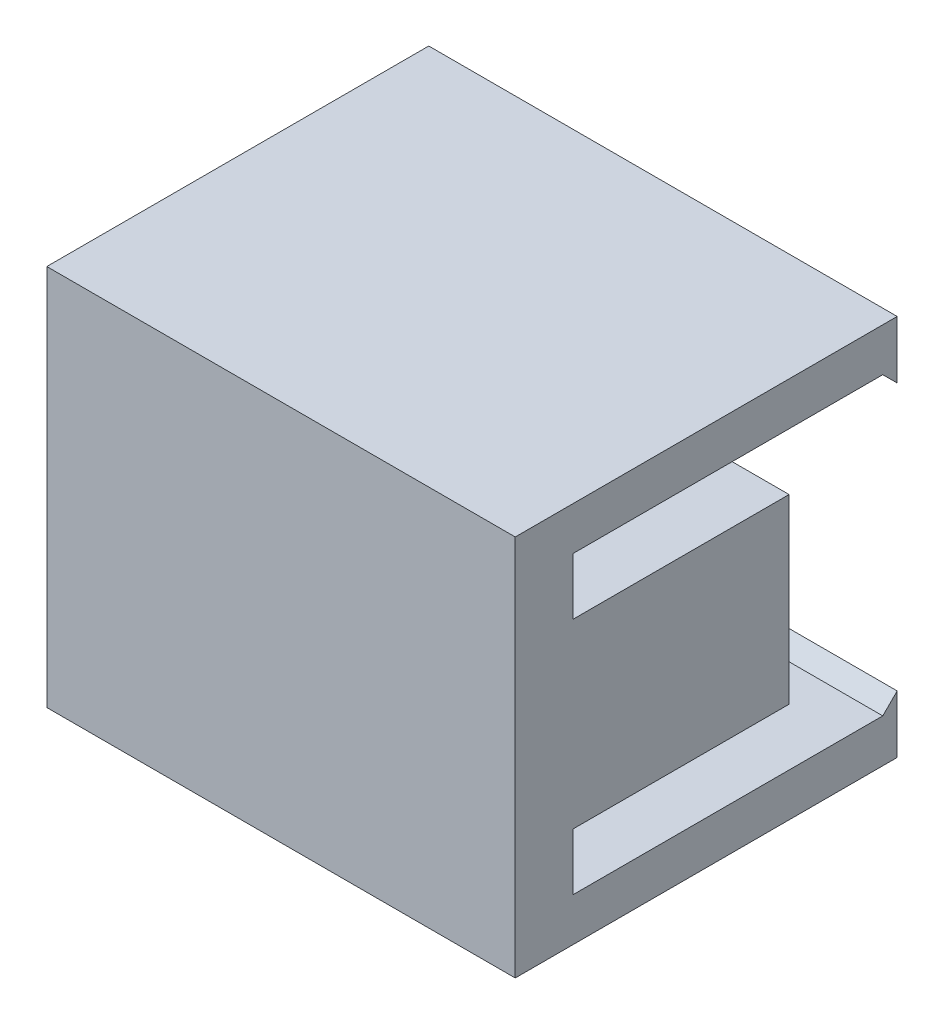
ISO-10303-21;
HEADER;
FILE_DESCRIPTION(('STEP AP214'),'2;1');
FILE_NAME('part.step','',(''),(''),'','','');
FILE_SCHEMA(('AUTOMOTIVE_DESIGN { 1 0 10303 214 1 1 1 1 }'));
ENDSEC;
DATA;
#1=APPLICATION_CONTEXT('core data for automotive mechanical design processes');
#2=APPLICATION_PROTOCOL_DEFINITION('international standard','automotive_design',2000,#1);
#3=PRODUCT_CONTEXT('',#1,'mechanical');
#4=PRODUCT('Part','Part','',(#3));
#5=PRODUCT_RELATED_PRODUCT_CATEGORY('part','',(#4));
#6=PRODUCT_DEFINITION_FORMATION('','',#4);
#7=PRODUCT_DEFINITION_CONTEXT('part definition',#1,'design');
#8=PRODUCT_DEFINITION('design','',#6,#7);
#9=PRODUCT_DEFINITION_SHAPE('','',#8);
#10=(LENGTH_UNIT() NAMED_UNIT(*) SI_UNIT(.MILLI.,.METRE.));
#11=(NAMED_UNIT(*) PLANE_ANGLE_UNIT() SI_UNIT($,.RADIAN.));
#12=(NAMED_UNIT(*) SI_UNIT($,.STERADIAN.) SOLID_ANGLE_UNIT());
#13=UNCERTAINTY_MEASURE_WITH_UNIT(LENGTH_MEASURE(1.E-05),#10,'distance_accuracy_value','');
#14=(GEOMETRIC_REPRESENTATION_CONTEXT(3) GLOBAL_UNCERTAINTY_ASSIGNED_CONTEXT((#13)) GLOBAL_UNIT_ASSIGNED_CONTEXT((#10,
#11,#12)) REPRESENTATION_CONTEXT('',''));
#15=CARTESIAN_POINT('',(0.,0.,0.));
#16=DIRECTION('',(0.,0.,1.));
#17=DIRECTION('',(1.,0.,0.));
#18=AXIS2_PLACEMENT_3D('',#15,#16,#17);
#19=CARTESIAN_POINT('',(0.,0.,0.));
#20=DIRECTION('',(0.,0.,1.));
#21=DIRECTION('',(1.,0.,0.));
#22=AXIS2_PLACEMENT_3D('',#19,#20,#21);
#23=PLANE('',#22);
#24=DIRECTION('',(1.,0.,0.));
#25=VECTOR('',#24,1.);
#26=CARTESIAN_POINT('',(0.,-2.01990678049208,0.));
#27=LINE('',#26,#25);
#28=CARTESIAN_POINT('',(-16.25,-2.01990678049208,0.));
#29=VERTEX_POINT('',#28);
#30=CARTESIAN_POINT('',(-13.25,-2.01990678049208,0.));
#31=VERTEX_POINT('',#30);
#32=EDGE_CURVE('E204',#29,#31,#27,.T.);
#33=ORIENTED_EDGE('',*,*,#32,.F.);
#34=DIRECTION('',(0.,-1.,0.));
#35=VECTOR('',#34,1.);
#36=CARTESIAN_POINT('',(-16.25,13.25,0.));
#37=LINE('',#36,#35);
#38=CARTESIAN_POINT('',(-16.25,2.,0.));
#39=VERTEX_POINT('',#38);
#40=EDGE_CURVE('E335',#39,#29,#37,.T.);
#41=ORIENTED_EDGE('',*,*,#40,.F.);
#42=DIRECTION('',(1.,0.,0.));
#43=VECTOR('',#42,1.);
#44=CARTESIAN_POINT('',(0.,2.,0.));
#45=LINE('',#44,#43);
#46=CARTESIAN_POINT('',(-13.25,2.,0.));
#47=VERTEX_POINT('',#46);
#48=EDGE_CURVE('E57',#39,#47,#45,.T.);
#49=ORIENTED_EDGE('',*,*,#48,.T.);
#50=DIRECTION('',(0.,-1.,0.));
#51=VECTOR('',#50,1.);
#52=CARTESIAN_POINT('',(-13.25,0.,0.));
#53=LINE('',#52,#51);
#54=CARTESIAN_POINT('',(-13.25,5.5,0.));
#55=VERTEX_POINT('',#54);
#56=EDGE_CURVE('E209',#55,#47,#53,.T.);
#57=ORIENTED_EDGE('',*,*,#56,.F.);
#58=DIRECTION('',(1.,0.,0.));
#59=VECTOR('',#58,1.);
#60=CARTESIAN_POINT('',(0.,5.5,0.));
#61=LINE('',#60,#59);
#62=CARTESIAN_POINT('',(-16.25,5.5,0.));
#63=VERTEX_POINT('',#62);
#64=EDGE_CURVE('E206',#63,#55,#61,.T.);
#65=ORIENTED_EDGE('',*,*,#64,.F.);
#66=CARTESIAN_POINT('',(-16.25,10.25,0.));
#67=VERTEX_POINT('',#66);
#68=EDGE_CURVE('E323',#67,#63,#37,.T.);
#69=ORIENTED_EDGE('',*,*,#68,.F.);
#70=DIRECTION('',(-1.,0.,0.));
#71=VECTOR('',#70,1.);
#72=CARTESIAN_POINT('',(0.,10.25,0.));
#73=LINE('',#72,#71);
#74=CARTESIAN_POINT('',(16.25,10.25,0.));
#75=VERTEX_POINT('',#74);
#76=EDGE_CURVE('E254',#75,#67,#73,.T.);
#77=ORIENTED_EDGE('',*,*,#76,.F.);
#78=DIRECTION('',(0.,1.,0.));
#79=VECTOR('',#78,1.);
#80=CARTESIAN_POINT('',(16.25,13.25,0.));
#81=LINE('',#80,#79);
#82=CARTESIAN_POINT('',(16.25,6.30000000000001,0.));
#83=VERTEX_POINT('',#82);
#84=EDGE_CURVE('E318',#83,#75,#81,.T.);
#85=ORIENTED_EDGE('',*,*,#84,.F.);
#86=DIRECTION('',(1.,0.,0.));
#87=VECTOR('',#86,1.);
#88=CARTESIAN_POINT('',(0.,6.30000000000001,0.));
#89=LINE('',#88,#87);
#90=CARTESIAN_POINT('',(9.75,6.30000000000001,0.));
#91=VERTEX_POINT('',#90);
#92=EDGE_CURVE('E293',#91,#83,#89,.T.);
#93=ORIENTED_EDGE('',*,*,#92,.F.);
#94=DIRECTION('',(0.,1.,0.));
#95=VECTOR('',#94,1.);
#96=CARTESIAN_POINT('',(9.75,0.,0.));
#97=LINE('',#96,#95);
#98=CARTESIAN_POINT('',(9.75,-6.29999999999999,0.));
#99=VERTEX_POINT('',#98);
#100=EDGE_CURVE('E302',#99,#91,#97,.T.);
#101=ORIENTED_EDGE('',*,*,#100,.F.);
#102=DIRECTION('',(1.,0.,0.));
#103=VECTOR('',#102,1.);
#104=CARTESIAN_POINT('',(0.,-6.29999999999999,0.));
#105=LINE('',#104,#103);
#106=CARTESIAN_POINT('',(16.25,-6.29999999999999,0.));
#107=VERTEX_POINT('',#106);
#108=EDGE_CURVE('E288',#99,#107,#105,.T.);
#109=ORIENTED_EDGE('',*,*,#108,.T.);
#110=CARTESIAN_POINT('',(16.25,-10.25,0.));
#111=VERTEX_POINT('',#110);
#112=EDGE_CURVE('E330',#111,#107,#81,.T.);
#113=ORIENTED_EDGE('',*,*,#112,.F.);
#114=DIRECTION('',(-1.,0.,0.));
#115=VECTOR('',#114,1.);
#116=CARTESIAN_POINT('',(0.,-10.25,0.));
#117=LINE('',#116,#115);
#118=CARTESIAN_POINT('',(-16.25,-10.25,0.));
#119=VERTEX_POINT('',#118);
#120=EDGE_CURVE('E271',#111,#119,#117,.T.);
#121=ORIENTED_EDGE('',*,*,#120,.T.);
#122=CARTESIAN_POINT('',(-16.25,-5.51990678049208,0.));
#123=VERTEX_POINT('',#122);
#124=EDGE_CURVE('E332',#123,#119,#37,.T.);
#125=ORIENTED_EDGE('',*,*,#124,.F.);
#126=DIRECTION('',(1.,0.,0.));
#127=VECTOR('',#126,1.);
#128=CARTESIAN_POINT('',(0.,-5.51990678049208,0.));
#129=LINE('',#128,#127);
#130=CARTESIAN_POINT('',(-13.25,-5.51990678049208,0.));
#131=VERTEX_POINT('',#130);
#132=EDGE_CURVE('E49',#123,#131,#129,.T.);
#133=ORIENTED_EDGE('',*,*,#132,.T.);
#134=DIRECTION('',(0.,-1.,0.));
#135=VECTOR('',#134,1.);
#136=CARTESIAN_POINT('',(-13.25,0.,0.));
#137=LINE('',#136,#135);
#138=EDGE_CURVE('E711',#31,#131,#137,.T.);
#139=ORIENTED_EDGE('',*,*,#138,.F.);
#140=EDGE_LOOP('',(#33,#41,#49,#57,#65,#69,#77,#85,#93,#101,#109,#113,#121,#125,#133,#139));
#141=FACE_BOUND('',#140,.T.);
#142=ADVANCED_FACE('F34',(#141),#23,.F.);
#143=CARTESIAN_POINT('',(0.,-10.25,-22.5));
#144=DIRECTION('',(0.,1.,0.));
#145=DIRECTION('',(0.,0.,1.));
#146=AXIS2_PLACEMENT_3D('',#143,#144,#145);
#147=PLANE('',#146);
#148=DIRECTION('',(0.,0.,1.));
#149=VECTOR('',#148,1.);
#150=CARTESIAN_POINT('',(16.25,-10.25,-22.5));
#151=LINE('',#150,#149);
#152=CARTESIAN_POINT('',(16.25,-10.25,-21.5));
#153=VERTEX_POINT('',#152);
#154=EDGE_CURVE('E286',#153,#111,#151,.T.);
#155=ORIENTED_EDGE('',*,*,#154,.F.);
#156=DIRECTION('',(1.,0.,0.));
#157=VECTOR('',#156,1.);
#158=CARTESIAN_POINT('',(0.,-10.25,-21.5));
#159=LINE('',#158,#157);
#160=CARTESIAN_POINT('',(-16.25,-10.25,-21.5));
#161=VERTEX_POINT('',#160);
#162=EDGE_CURVE('E250',#161,#153,#159,.T.);
#163=ORIENTED_EDGE('',*,*,#162,.F.);
#164=DIRECTION('',(0.,0.,1.));
#165=VECTOR('',#164,1.);
#166=CARTESIAN_POINT('',(-16.25,-10.25,-22.5));
#167=LINE('',#166,#165);
#168=EDGE_CURVE('E281',#161,#119,#167,.T.);
#169=ORIENTED_EDGE('',*,*,#168,.T.);
#170=ORIENTED_EDGE('',*,*,#120,.F.);
#171=EDGE_LOOP('',(#155,#163,#169,#170));
#172=FACE_BOUND('',#171,.T.);
#173=ADVANCED_FACE('F386',(#172),#147,.T.);
#174=CARTESIAN_POINT('',(16.25,13.25,4.));
#175=DIRECTION('',(-1.,0.,0.));
#176=DIRECTION('',(0.,-1.,0.));
#177=AXIS2_PLACEMENT_3D('',#174,#175,#176);
#178=PLANE('',#177);
#179=DIRECTION('',(0.,0.,1.));
#180=VECTOR('',#179,1.);
#181=CARTESIAN_POINT('',(16.25,10.25,-22.5));
#182=LINE('',#181,#180);
#183=CARTESIAN_POINT('',(16.25,10.25,-21.5));
#184=VERTEX_POINT('',#183);
#185=EDGE_CURVE('E269',#184,#75,#182,.T.);
#186=ORIENTED_EDGE('',*,*,#185,.F.);
#187=DIRECTION('',(0.,-0.707106781186547,-0.707106781186547));
#188=VECTOR('',#187,1.);
#189=CARTESIAN_POINT('',(16.25,9.25,-22.5));
#190=LINE('',#189,#188);
#191=CARTESIAN_POINT('',(16.25,9.25,-22.5));
#192=VERTEX_POINT('',#191);
#193=EDGE_CURVE('E237',#184,#192,#190,.T.);
#194=ORIENTED_EDGE('',*,*,#193,.T.);
#195=DIRECTION('',(0.,-1.,0.));
#196=VECTOR('',#195,1.);
#197=CARTESIAN_POINT('',(16.25,0.,-22.5));
#198=LINE('',#197,#196);
#199=CARTESIAN_POINT('',(16.25,13.25,-22.5));
#200=VERTEX_POINT('',#199);
#201=EDGE_CURVE('E256',#200,#192,#198,.T.);
#202=ORIENTED_EDGE('',*,*,#201,.F.);
#203=DIRECTION('',(0.,0.,-1.));
#204=VECTOR('',#203,1.);
#205=CARTESIAN_POINT('',(16.25,13.25,4.));
#206=LINE('',#205,#204);
#207=CARTESIAN_POINT('',(16.25,13.25,4.));
#208=VERTEX_POINT('',#207);
#209=EDGE_CURVE('E11',#208,#200,#206,.T.);
#210=ORIENTED_EDGE('',*,*,#209,.F.);
#211=DIRECTION('',(0.,1.,0.));
#212=VECTOR('',#211,1.);
#213=CARTESIAN_POINT('',(16.25,13.25,4.));
#214=LINE('',#213,#212);
#215=CARTESIAN_POINT('',(16.25,-13.25,4.));
#216=VERTEX_POINT('',#215);
#217=EDGE_CURVE('E319',#216,#208,#214,.T.);
#218=ORIENTED_EDGE('',*,*,#217,.F.);
#219=DIRECTION('',(0.,0.,-1.));
#220=VECTOR('',#219,1.);
#221=CARTESIAN_POINT('',(16.25,-13.25,4.));
#222=LINE('',#221,#220);
#223=CARTESIAN_POINT('',(16.25,-13.25,-22.5));
#224=VERTEX_POINT('',#223);
#225=EDGE_CURVE('E329',#216,#224,#222,.T.);
#226=ORIENTED_EDGE('',*,*,#225,.T.);
#227=DIRECTION('',(0.,-1.,0.));
#228=VECTOR('',#227,1.);
#229=CARTESIAN_POINT('',(16.25,0.,-22.5));
#230=LINE('',#229,#228);
#231=CARTESIAN_POINT('',(16.25,-9.25,-22.5));
#232=VERTEX_POINT('',#231);
#233=EDGE_CURVE('E272',#232,#224,#230,.T.);
#234=ORIENTED_EDGE('',*,*,#233,.F.);
#235=DIRECTION('',(0.,-0.707106781186547,0.707106781186547));
#236=VECTOR('',#235,1.);
#237=CARTESIAN_POINT('',(16.25,-10.25,-21.5));
#238=LINE('',#237,#236);
#239=EDGE_CURVE('E247',#232,#153,#238,.T.);
#240=ORIENTED_EDGE('',*,*,#239,.T.);
#241=ORIENTED_EDGE('',*,*,#154,.T.);
#242=ORIENTED_EDGE('',*,*,#112,.T.);
#243=DIRECTION('',(0.,0.,1.));
#244=VECTOR('',#243,1.);
#245=CARTESIAN_POINT('',(16.25,-6.29999999999999,-15.));
#246=LINE('',#245,#244);
#247=CARTESIAN_POINT('',(16.25,-6.29999999999999,-15.));
#248=VERTEX_POINT('',#247);
#249=EDGE_CURVE('E299',#248,#107,#246,.T.);
#250=ORIENTED_EDGE('',*,*,#249,.F.);
#251=DIRECTION('',(0.,-1.,0.));
#252=VECTOR('',#251,1.);
#253=CARTESIAN_POINT('',(16.25,0.,-15.));
#254=LINE('',#253,#252);
#255=CARTESIAN_POINT('',(16.25,6.30000000000001,-15.));
#256=VERTEX_POINT('',#255);
#257=EDGE_CURVE('E297',#256,#248,#254,.T.);
#258=ORIENTED_EDGE('',*,*,#257,.F.);
#259=DIRECTION('',(0.,0.,1.));
#260=VECTOR('',#259,1.);
#261=CARTESIAN_POINT('',(16.25,6.30000000000001,-15.));
#262=LINE('',#261,#260);
#263=EDGE_CURVE('E309',#256,#83,#262,.T.);
#264=ORIENTED_EDGE('',*,*,#263,.T.);
#265=ORIENTED_EDGE('',*,*,#84,.T.);
#266=EDGE_LOOP('',(#186,#194,#202,#210,#218,#226,#234,#240,#241,#242,#250,#258,#264,#265));
#267=FACE_BOUND('',#266,.T.);
#268=ADVANCED_FACE('F36',(#267),#178,.F.);
#269=CARTESIAN_POINT('',(-16.25,13.25,4.));
#270=DIRECTION('',(0.,-1.,0.));
#271=DIRECTION('',(0.,0.,-1.));
#272=AXIS2_PLACEMENT_3D('',#269,#270,#271);
#273=PLANE('',#272);
#274=ORIENTED_EDGE('',*,*,#209,.T.);
#275=DIRECTION('',(1.,0.,0.));
#276=VECTOR('',#275,1.);
#277=CARTESIAN_POINT('',(0.,13.25,-22.5));
#278=LINE('',#277,#276);
#279=CARTESIAN_POINT('',(-16.25,13.25,-22.5));
#280=VERTEX_POINT('',#279);
#281=EDGE_CURVE('E262',#280,#200,#278,.T.);
#282=ORIENTED_EDGE('',*,*,#281,.F.);
#283=DIRECTION('',(0.,0.,-1.));
#284=VECTOR('',#283,1.);
#285=CARTESIAN_POINT('',(-16.25,13.25,4.));
#286=LINE('',#285,#284);
#287=CARTESIAN_POINT('',(-16.25,13.25,4.));
#288=VERTEX_POINT('',#287);
#289=EDGE_CURVE('E42',#288,#280,#286,.T.);
#290=ORIENTED_EDGE('',*,*,#289,.F.);
#291=DIRECTION('',(-1.,0.,0.));
#292=VECTOR('',#291,1.);
#293=CARTESIAN_POINT('',(-16.25,13.25,4.));
#294=LINE('',#293,#292);
#295=EDGE_CURVE('E322',#208,#288,#294,.T.);
#296=ORIENTED_EDGE('',*,*,#295,.F.);
#297=EDGE_LOOP('',(#274,#282,#290,#296));
#298=FACE_BOUND('',#297,.T.);
#299=ADVANCED_FACE('F351',(#298),#273,.F.);
#300=CARTESIAN_POINT('',(-16.25,13.25,4.));
#301=DIRECTION('',(1.,0.,0.));
#302=DIRECTION('',(0.,0.,-1.));
#303=AXIS2_PLACEMENT_3D('',#300,#301,#302);
#304=PLANE('',#303);
#305=DIRECTION('',(0.,1.,0.));
#306=VECTOR('',#305,1.);
#307=CARTESIAN_POINT('',(-16.25,0.,-22.5));
#308=LINE('',#307,#306);
#309=CARTESIAN_POINT('',(-16.25,9.25,-22.5));
#310=VERTEX_POINT('',#309);
#311=EDGE_CURVE('E259',#310,#280,#308,.T.);
#312=ORIENTED_EDGE('',*,*,#311,.F.);
#313=DIRECTION('',(0.,-0.707106781186547,-0.707106781186547));
#314=VECTOR('',#313,1.);
#315=CARTESIAN_POINT('',(-16.25,9.25,-22.5));
#316=LINE('',#315,#314);
#317=CARTESIAN_POINT('',(-16.25,10.25,-21.5));
#318=VERTEX_POINT('',#317);
#319=EDGE_CURVE('E236',#318,#310,#316,.T.);
#320=ORIENTED_EDGE('',*,*,#319,.F.);
#321=DIRECTION('',(0.,0.,1.));
#322=VECTOR('',#321,1.);
#323=CARTESIAN_POINT('',(-16.25,10.25,-22.5));
#324=LINE('',#323,#322);
#325=EDGE_CURVE('E265',#318,#67,#324,.T.);
#326=ORIENTED_EDGE('',*,*,#325,.T.);
#327=ORIENTED_EDGE('',*,*,#68,.T.);
#328=DIRECTION('',(0.,0.,1.));
#329=VECTOR('',#328,1.);
#330=CARTESIAN_POINT('',(-16.25,5.5,-15.));
#331=LINE('',#330,#329);
#332=CARTESIAN_POINT('',(-16.25,5.5,-15.));
#333=VERTEX_POINT('',#332);
#334=EDGE_CURVE('E224',#333,#63,#331,.T.);
#335=ORIENTED_EDGE('',*,*,#334,.F.);
#336=DIRECTION('',(0.,1.,0.));
#337=VECTOR('',#336,1.);
#338=CARTESIAN_POINT('',(-16.25,0.,-15.));
#339=LINE('',#338,#337);
#340=CARTESIAN_POINT('',(-16.25,2.,-15.));
#341=VERTEX_POINT('',#340);
#342=EDGE_CURVE('E223',#341,#333,#339,.T.);
#343=ORIENTED_EDGE('',*,*,#342,.F.);
#344=DIRECTION('',(0.,0.,1.));
#345=VECTOR('',#344,1.);
#346=CARTESIAN_POINT('',(-16.25,2.,-15.));
#347=LINE('',#346,#345);
#348=EDGE_CURVE('E230',#341,#39,#347,.T.);
#349=ORIENTED_EDGE('',*,*,#348,.T.);
#350=ORIENTED_EDGE('',*,*,#40,.T.);
#351=DIRECTION('',(0.,0.,1.));
#352=VECTOR('',#351,1.);
#353=CARTESIAN_POINT('',(-16.25,-2.01990678049208,-15.));
#354=LINE('',#353,#352);
#355=CARTESIAN_POINT('',(-16.25,-2.01990678049208,-15.));
#356=VERTEX_POINT('',#355);
#357=EDGE_CURVE('E716',#356,#29,#354,.T.);
#358=ORIENTED_EDGE('',*,*,#357,.F.);
#359=DIRECTION('',(0.,1.,0.));
#360=VECTOR('',#359,1.);
#361=CARTESIAN_POINT('',(-16.25,0.,-15.));
#362=LINE('',#361,#360);
#363=CARTESIAN_POINT('',(-16.25,-5.51990678049208,-15.));
#364=VERTEX_POINT('',#363);
#365=EDGE_CURVE('E198',#364,#356,#362,.T.);
#366=ORIENTED_EDGE('',*,*,#365,.F.);
#367=DIRECTION('',(0.,0.,1.));
#368=VECTOR('',#367,1.);
#369=CARTESIAN_POINT('',(-16.25,-5.51990678049208,-15.));
#370=LINE('',#369,#368);
#371=EDGE_CURVE('E211',#364,#123,#370,.T.);
#372=ORIENTED_EDGE('',*,*,#371,.T.);
#373=ORIENTED_EDGE('',*,*,#124,.T.);
#374=ORIENTED_EDGE('',*,*,#168,.F.);
#375=DIRECTION('',(0.,-0.707106781186547,0.707106781186547));
#376=VECTOR('',#375,1.);
#377=CARTESIAN_POINT('',(-16.25,-10.25,-21.5));
#378=LINE('',#377,#376);
#379=CARTESIAN_POINT('',(-16.25,-9.25,-22.5));
#380=VERTEX_POINT('',#379);
#381=EDGE_CURVE('E244',#380,#161,#378,.T.);
#382=ORIENTED_EDGE('',*,*,#381,.F.);
#383=DIRECTION('',(0.,1.,0.));
#384=VECTOR('',#383,1.);
#385=CARTESIAN_POINT('',(-16.25,0.,-22.5));
#386=LINE('',#385,#384);
#387=CARTESIAN_POINT('',(-16.25,-13.25,-22.5));
#388=VERTEX_POINT('',#387);
#389=EDGE_CURVE('E278',#388,#380,#386,.T.);
#390=ORIENTED_EDGE('',*,*,#389,.F.);
#391=DIRECTION('',(0.,0.,-1.));
#392=VECTOR('',#391,1.);
#393=CARTESIAN_POINT('',(-16.25,-13.25,4.));
#394=LINE('',#393,#392);
#395=CARTESIAN_POINT('',(-16.25,-13.25,4.));
#396=VERTEX_POINT('',#395);
#397=EDGE_CURVE('E337',#396,#388,#394,.T.);
#398=ORIENTED_EDGE('',*,*,#397,.F.);
#399=DIRECTION('',(0.,-1.,0.));
#400=VECTOR('',#399,1.);
#401=CARTESIAN_POINT('',(-16.25,13.25,4.));
#402=LINE('',#401,#400);
#403=EDGE_CURVE('E325',#288,#396,#402,.T.);
#404=ORIENTED_EDGE('',*,*,#403,.F.);
#405=ORIENTED_EDGE('',*,*,#289,.T.);
#406=EDGE_LOOP('',(#312,#320,#326,#327,#335,#343,#349,#350,#358,#366,#372,#373,#374,#382,#390,
#398,#404,#405));
#407=FACE_BOUND('',#406,.T.);
#408=ADVANCED_FACE('F342',(#407),#304,.F.);
#409=CARTESIAN_POINT('',(-16.25,-13.25,4.));
#410=DIRECTION('',(0.,1.,0.));
#411=DIRECTION('',(0.,0.,1.));
#412=AXIS2_PLACEMENT_3D('',#409,#410,#411);
#413=PLANE('',#412);
#414=ORIENTED_EDGE('',*,*,#397,.T.);
#415=DIRECTION('',(-1.,0.,0.));
#416=VECTOR('',#415,1.);
#417=CARTESIAN_POINT('',(0.,-13.25,-22.5));
#418=LINE('',#417,#416);
#419=EDGE_CURVE('E275',#224,#388,#418,.T.);
#420=ORIENTED_EDGE('',*,*,#419,.F.);
#421=ORIENTED_EDGE('',*,*,#225,.F.);
#422=DIRECTION('',(1.,0.,0.));
#423=VECTOR('',#422,1.);
#424=CARTESIAN_POINT('',(-16.25,-13.25,4.));
#425=LINE('',#424,#423);
#426=EDGE_CURVE('E327',#396,#216,#425,.T.);
#427=ORIENTED_EDGE('',*,*,#426,.F.);
#428=EDGE_LOOP('',(#414,#420,#421,#427));
#429=FACE_BOUND('',#428,.T.);
#430=ADVANCED_FACE('F401',(#429),#413,.F.);
#431=CARTESIAN_POINT('',(0.,0.,4.));
#432=DIRECTION('',(0.,0.,1.));
#433=DIRECTION('',(1.,0.,0.));
#434=AXIS2_PLACEMENT_3D('',#431,#432,#433);
#435=PLANE('',#434);
#436=ORIENTED_EDGE('',*,*,#217,.T.);
#437=ORIENTED_EDGE('',*,*,#295,.T.);
#438=ORIENTED_EDGE('',*,*,#403,.T.);
#439=ORIENTED_EDGE('',*,*,#426,.T.);
#440=EDGE_LOOP('',(#436,#437,#438,#439));
#441=FACE_BOUND('',#440,.T.);
#442=ADVANCED_FACE('F404',(#441),#435,.T.);
#443=CARTESIAN_POINT('',(0.,-6.29999999999999,-15.));
#444=DIRECTION('',(0.,-1.,0.));
#445=DIRECTION('',(1.,0.,0.));
#446=AXIS2_PLACEMENT_3D('',#443,#444,#445);
#447=PLANE('',#446);
#448=ORIENTED_EDGE('',*,*,#108,.F.);
#449=DIRECTION('',(0.,0.,1.));
#450=VECTOR('',#449,1.);
#451=CARTESIAN_POINT('',(9.75,-6.29999999999999,-15.));
#452=LINE('',#451,#450);
#453=CARTESIAN_POINT('',(9.75,-6.29999999999999,-15.));
#454=VERTEX_POINT('',#453);
#455=EDGE_CURVE('E315',#454,#99,#452,.T.);
#456=ORIENTED_EDGE('',*,*,#455,.F.);
#457=DIRECTION('',(1.,0.,0.));
#458=VECTOR('',#457,1.);
#459=CARTESIAN_POINT('',(0.,-6.29999999999999,-15.));
#460=LINE('',#459,#458);
#461=EDGE_CURVE('E289',#454,#248,#460,.T.);
#462=ORIENTED_EDGE('',*,*,#461,.T.);
#463=ORIENTED_EDGE('',*,*,#249,.T.);
#464=EDGE_LOOP('',(#448,#456,#462,#463));
#465=FACE_BOUND('',#464,.T.);
#466=ADVANCED_FACE('F406',(#465),#447,.T.);
#467=CARTESIAN_POINT('',(9.75,0.,-15.));
#468=DIRECTION('',(1.,0.,0.));
#469=DIRECTION('',(0.,0.,-1.));
#470=AXIS2_PLACEMENT_3D('',#467,#468,#469);
#471=PLANE('',#470);
#472=ORIENTED_EDGE('',*,*,#100,.T.);
#473=DIRECTION('',(0.,0.,1.));
#474=VECTOR('',#473,1.);
#475=CARTESIAN_POINT('',(9.75,6.30000000000001,-15.));
#476=LINE('',#475,#474);
#477=CARTESIAN_POINT('',(9.75,6.30000000000001,-15.));
#478=VERTEX_POINT('',#477);
#479=EDGE_CURVE('E312',#478,#91,#476,.T.);
#480=ORIENTED_EDGE('',*,*,#479,.F.);
#481=DIRECTION('',(0.,1.,0.));
#482=VECTOR('',#481,1.);
#483=CARTESIAN_POINT('',(9.75,0.,-15.));
#484=LINE('',#483,#482);
#485=EDGE_CURVE('E292',#454,#478,#484,.T.);
#486=ORIENTED_EDGE('',*,*,#485,.F.);
#487=ORIENTED_EDGE('',*,*,#455,.T.);
#488=EDGE_LOOP('',(#472,#480,#486,#487));
#489=FACE_BOUND('',#488,.T.);
#490=ADVANCED_FACE('F412',(#489),#471,.F.);
#491=CARTESIAN_POINT('',(0.,6.30000000000001,-15.));
#492=DIRECTION('',(0.,-1.,0.));
#493=DIRECTION('',(1.,0.,0.));
#494=AXIS2_PLACEMENT_3D('',#491,#492,#493);
#495=PLANE('',#494);
#496=ORIENTED_EDGE('',*,*,#92,.T.);
#497=ORIENTED_EDGE('',*,*,#263,.F.);
#498=DIRECTION('',(1.,0.,0.));
#499=VECTOR('',#498,1.);
#500=CARTESIAN_POINT('',(0.,6.30000000000001,-15.));
#501=LINE('',#500,#499);
#502=EDGE_CURVE('E295',#478,#256,#501,.T.);
#503=ORIENTED_EDGE('',*,*,#502,.F.);
#504=ORIENTED_EDGE('',*,*,#479,.T.);
#505=EDGE_LOOP('',(#496,#497,#503,#504));
#506=FACE_BOUND('',#505,.T.);
#507=ADVANCED_FACE('F651',(#506),#495,.F.);
#508=CARTESIAN_POINT('',(0.,0.,-15.));
#509=DIRECTION('',(0.,0.,-1.));
#510=DIRECTION('',(-1.,0.,0.));
#511=AXIS2_PLACEMENT_3D('',#508,#509,#510);
#512=PLANE('',#511);
#513=ORIENTED_EDGE('',*,*,#461,.F.);
#514=ORIENTED_EDGE('',*,*,#485,.T.);
#515=ORIENTED_EDGE('',*,*,#502,.T.);
#516=ORIENTED_EDGE('',*,*,#257,.T.);
#517=EDGE_LOOP('',(#513,#514,#515,#516));
#518=FACE_BOUND('',#517,.T.);
#519=ADVANCED_FACE('F449',(#518),#512,.T.);
#520=CARTESIAN_POINT('',(0.,0.,-22.5));
#521=DIRECTION('',(0.,0.,-1.));
#522=DIRECTION('',(-1.,0.,0.));
#523=AXIS2_PLACEMENT_3D('',#520,#521,#522);
#524=PLANE('',#523);
#525=ORIENTED_EDGE('',*,*,#389,.T.);
#526=DIRECTION('',(-1.,0.,0.));
#527=VECTOR('',#526,1.);
#528=CARTESIAN_POINT('',(0.,-9.25,-22.5));
#529=LINE('',#528,#527);
#530=EDGE_CURVE('E252',#232,#380,#529,.T.);
#531=ORIENTED_EDGE('',*,*,#530,.F.);
#532=ORIENTED_EDGE('',*,*,#233,.T.);
#533=ORIENTED_EDGE('',*,*,#419,.T.);
#534=EDGE_LOOP('',(#525,#531,#532,#533));
#535=FACE_BOUND('',#534,.T.);
#536=ADVANCED_FACE('F397',(#535),#524,.T.);
#537=CARTESIAN_POINT('',(0.,10.25,-22.5));
#538=DIRECTION('',(0.,1.,0.));
#539=DIRECTION('',(0.,0.,1.));
#540=AXIS2_PLACEMENT_3D('',#537,#538,#539);
#541=PLANE('',#540);
#542=ORIENTED_EDGE('',*,*,#325,.F.);
#543=DIRECTION('',(1.,0.,0.));
#544=VECTOR('',#543,1.);
#545=CARTESIAN_POINT('',(-16.25,10.25,-21.5));
#546=LINE('',#545,#544);
#547=EDGE_CURVE('E240',#318,#184,#546,.T.);
#548=ORIENTED_EDGE('',*,*,#547,.T.);
#549=ORIENTED_EDGE('',*,*,#185,.T.);
#550=ORIENTED_EDGE('',*,*,#76,.T.);
#551=EDGE_LOOP('',(#542,#548,#549,#550));
#552=FACE_BOUND('',#551,.T.);
#553=ADVANCED_FACE('F361',(#552),#541,.F.);
#554=CARTESIAN_POINT('',(0.,0.,-22.5));
#555=DIRECTION('',(0.,0.,-1.));
#556=DIRECTION('',(-1.,0.,0.));
#557=AXIS2_PLACEMENT_3D('',#554,#555,#556);
#558=PLANE('',#557);
#559=ORIENTED_EDGE('',*,*,#201,.T.);
#560=DIRECTION('',(1.,0.,0.));
#561=VECTOR('',#560,1.);
#562=CARTESIAN_POINT('',(-16.25,9.25,-22.5));
#563=LINE('',#562,#561);
#564=EDGE_CURVE('E242',#310,#192,#563,.T.);
#565=ORIENTED_EDGE('',*,*,#564,.F.);
#566=ORIENTED_EDGE('',*,*,#311,.T.);
#567=ORIENTED_EDGE('',*,*,#281,.T.);
#568=EDGE_LOOP('',(#559,#565,#566,#567));
#569=FACE_BOUND('',#568,.T.);
#570=ADVANCED_FACE('F349',(#569),#558,.T.);
#571=CARTESIAN_POINT('',(16.25,-10.25,-21.5));
#572=DIRECTION('',(0.,-0.707106781186547,-0.707106781186547));
#573=DIRECTION('',(0.,0.707106781186548,-0.707106781186548));
#574=AXIS2_PLACEMENT_3D('',#571,#572,#573);
#575=PLANE('',#574);
#576=ORIENTED_EDGE('',*,*,#381,.T.);
#577=ORIENTED_EDGE('',*,*,#162,.T.);
#578=ORIENTED_EDGE('',*,*,#239,.F.);
#579=ORIENTED_EDGE('',*,*,#530,.T.);
#580=EDGE_LOOP('',(#576,#577,#578,#579));
#581=FACE_BOUND('',#580,.T.);
#582=ADVANCED_FACE('F394',(#581),#575,.F.);
#583=CARTESIAN_POINT('',(16.25,9.25,-22.5));
#584=DIRECTION('',(0.,0.707106781186547,-0.707106781186547));
#585=DIRECTION('',(0.,0.707106781186548,0.707106781186548));
#586=AXIS2_PLACEMENT_3D('',#583,#584,#585);
#587=PLANE('',#586);
#588=ORIENTED_EDGE('',*,*,#319,.T.);
#589=ORIENTED_EDGE('',*,*,#564,.T.);
#590=ORIENTED_EDGE('',*,*,#193,.F.);
#591=ORIENTED_EDGE('',*,*,#547,.F.);
#592=EDGE_LOOP('',(#588,#589,#590,#591));
#593=FACE_BOUND('',#592,.T.);
#594=ADVANCED_FACE('F358',(#593),#587,.F.);
#595=CARTESIAN_POINT('',(0.,5.5,-15.));
#596=DIRECTION('',(0.,-1.,0.));
#597=DIRECTION('',(0.,0.,-1.));
#598=AXIS2_PLACEMENT_3D('',#595,#596,#597);
#599=PLANE('',#598);
#600=ORIENTED_EDGE('',*,*,#64,.T.);
#601=DIRECTION('',(0.,0.,1.));
#602=VECTOR('',#601,1.);
#603=CARTESIAN_POINT('',(-13.25,5.5,-15.));
#604=LINE('',#603,#602);
#605=CARTESIAN_POINT('',(-13.25,5.5,-15.));
#606=VERTEX_POINT('',#605);
#607=EDGE_CURVE('E234',#606,#55,#604,.T.);
#608=ORIENTED_EDGE('',*,*,#607,.F.);
#609=DIRECTION('',(1.,0.,0.));
#610=VECTOR('',#609,1.);
#611=CARTESIAN_POINT('',(0.,5.5,-15.));
#612=LINE('',#611,#610);
#613=EDGE_CURVE('E215',#333,#606,#612,.T.);
#614=ORIENTED_EDGE('',*,*,#613,.F.);
#615=ORIENTED_EDGE('',*,*,#334,.T.);
#616=EDGE_LOOP('',(#600,#608,#614,#615));
#617=FACE_BOUND('',#616,.T.);
#618=ADVANCED_FACE('F372',(#617),#599,.F.);
#619=CARTESIAN_POINT('',(-13.25,0.,-15.));
#620=DIRECTION('',(-1.,0.,0.));
#621=DIRECTION('',(0.,0.,1.));
#622=AXIS2_PLACEMENT_3D('',#619,#620,#621);
#623=PLANE('',#622);
#624=ORIENTED_EDGE('',*,*,#56,.T.);
#625=DIRECTION('',(0.,0.,1.));
#626=VECTOR('',#625,1.);
#627=CARTESIAN_POINT('',(-13.25,2.,-15.));
#628=LINE('',#627,#626);
#629=CARTESIAN_POINT('',(-13.25,2.,-15.));
#630=VERTEX_POINT('',#629);
#631=EDGE_CURVE('E232',#630,#47,#628,.T.);
#632=ORIENTED_EDGE('',*,*,#631,.F.);
#633=DIRECTION('',(0.,-1.,0.));
#634=VECTOR('',#633,1.);
#635=CARTESIAN_POINT('',(-13.25,0.,-15.));
#636=LINE('',#635,#634);
#637=EDGE_CURVE('E218',#606,#630,#636,.T.);
#638=ORIENTED_EDGE('',*,*,#637,.F.);
#639=ORIENTED_EDGE('',*,*,#607,.T.);
#640=EDGE_LOOP('',(#624,#632,#638,#639));
#641=FACE_BOUND('',#640,.T.);
#642=ADVANCED_FACE('F477',(#641),#623,.F.);
#643=CARTESIAN_POINT('',(0.,2.,-15.));
#644=DIRECTION('',(0.,-1.,0.));
#645=DIRECTION('',(0.,0.,-1.));
#646=AXIS2_PLACEMENT_3D('',#643,#644,#645);
#647=PLANE('',#646);
#648=ORIENTED_EDGE('',*,*,#48,.F.);
#649=ORIENTED_EDGE('',*,*,#348,.F.);
#650=DIRECTION('',(1.,0.,0.));
#651=VECTOR('',#650,1.);
#652=CARTESIAN_POINT('',(0.,2.,-15.));
#653=LINE('',#652,#651);
#654=EDGE_CURVE('E220',#341,#630,#653,.T.);
#655=ORIENTED_EDGE('',*,*,#654,.T.);
#656=ORIENTED_EDGE('',*,*,#631,.T.);
#657=EDGE_LOOP('',(#648,#649,#655,#656));
#658=FACE_BOUND('',#657,.T.);
#659=ADVANCED_FACE('F485',(#658),#647,.T.);
#660=CARTESIAN_POINT('',(0.,0.,-15.));
#661=DIRECTION('',(0.,0.,-1.));
#662=DIRECTION('',(-1.,0.,0.));
#663=AXIS2_PLACEMENT_3D('',#660,#661,#662);
#664=PLANE('',#663);
#665=ORIENTED_EDGE('',*,*,#613,.T.);
#666=ORIENTED_EDGE('',*,*,#637,.T.);
#667=ORIENTED_EDGE('',*,*,#654,.F.);
#668=ORIENTED_EDGE('',*,*,#342,.T.);
#669=EDGE_LOOP('',(#665,#666,#667,#668));
#670=FACE_BOUND('',#669,.T.);
#671=ADVANCED_FACE('F374',(#670),#664,.T.);
#672=CARTESIAN_POINT('',(0.,-2.01990678049208,-15.));
#673=DIRECTION('',(0.,-1.,0.));
#674=DIRECTION('',(0.,0.,-1.));
#675=AXIS2_PLACEMENT_3D('',#672,#673,#674);
#676=PLANE('',#675);
#677=ORIENTED_EDGE('',*,*,#32,.T.);
#678=DIRECTION('',(0.,0.,1.));
#679=VECTOR('',#678,1.);
#680=CARTESIAN_POINT('',(-13.25,-2.01990678049208,-15.));
#681=LINE('',#680,#679);
#682=CARTESIAN_POINT('',(-13.25,-2.01990678049208,-15.));
#683=VERTEX_POINT('',#682);
#684=EDGE_CURVE('E186',#683,#31,#681,.T.);
#685=ORIENTED_EDGE('',*,*,#684,.F.);
#686=DIRECTION('',(1.,0.,0.));
#687=VECTOR('',#686,1.);
#688=CARTESIAN_POINT('',(0.,-2.01990678049208,-15.));
#689=LINE('',#688,#687);
#690=EDGE_CURVE('E193',#356,#683,#689,.T.);
#691=ORIENTED_EDGE('',*,*,#690,.F.);
#692=ORIENTED_EDGE('',*,*,#357,.T.);
#693=EDGE_LOOP('',(#677,#685,#691,#692));
#694=FACE_BOUND('',#693,.T.);
#695=ADVANCED_FACE('F202',(#694),#676,.F.);
#696=CARTESIAN_POINT('',(-13.25,0.,-15.));
#697=DIRECTION('',(-1.,0.,0.));
#698=DIRECTION('',(0.,0.,1.));
#699=AXIS2_PLACEMENT_3D('',#696,#697,#698);
#700=PLANE('',#699);
#701=ORIENTED_EDGE('',*,*,#138,.T.);
#702=DIRECTION('',(0.,0.,1.));
#703=VECTOR('',#702,1.);
#704=CARTESIAN_POINT('',(-13.25,-5.51990678049208,-15.));
#705=LINE('',#704,#703);
#706=CARTESIAN_POINT('',(-13.25,-5.51990678049208,-15.));
#707=VERTEX_POINT('',#706);
#708=EDGE_CURVE('E188',#707,#131,#705,.T.);
#709=ORIENTED_EDGE('',*,*,#708,.F.);
#710=DIRECTION('',(0.,-1.,0.));
#711=VECTOR('',#710,1.);
#712=CARTESIAN_POINT('',(-13.25,0.,-15.));
#713=LINE('',#712,#711);
#714=EDGE_CURVE('E181',#683,#707,#713,.T.);
#715=ORIENTED_EDGE('',*,*,#714,.F.);
#716=ORIENTED_EDGE('',*,*,#684,.T.);
#717=EDGE_LOOP('',(#701,#709,#715,#716));
#718=FACE_BOUND('',#717,.T.);
#719=ADVANCED_FACE('F184',(#718),#700,.F.);
#720=CARTESIAN_POINT('',(0.,-5.51990678049208,-15.));
#721=DIRECTION('',(0.,-1.,0.));
#722=DIRECTION('',(0.,0.,-1.));
#723=AXIS2_PLACEMENT_3D('',#720,#721,#722);
#724=PLANE('',#723);
#725=ORIENTED_EDGE('',*,*,#132,.F.);
#726=ORIENTED_EDGE('',*,*,#371,.F.);
#727=DIRECTION('',(1.,0.,0.));
#728=VECTOR('',#727,1.);
#729=CARTESIAN_POINT('',(0.,-5.51990678049208,-15.));
#730=LINE('',#729,#728);
#731=EDGE_CURVE('E192',#364,#707,#730,.T.);
#732=ORIENTED_EDGE('',*,*,#731,.T.);
#733=ORIENTED_EDGE('',*,*,#708,.T.);
#734=EDGE_LOOP('',(#725,#726,#732,#733));
#735=FACE_BOUND('',#734,.T.);
#736=ADVANCED_FACE('F511',(#735),#724,.T.);
#737=CARTESIAN_POINT('',(0.,0.,-15.));
#738=DIRECTION('',(0.,0.,-1.));
#739=DIRECTION('',(-1.,0.,0.));
#740=AXIS2_PLACEMENT_3D('',#737,#738,#739);
#741=PLANE('',#740);
#742=ORIENTED_EDGE('',*,*,#690,.T.);
#743=ORIENTED_EDGE('',*,*,#714,.T.);
#744=ORIENTED_EDGE('',*,*,#731,.F.);
#745=ORIENTED_EDGE('',*,*,#365,.T.);
#746=EDGE_LOOP('',(#742,#743,#744,#745));
#747=FACE_BOUND('',#746,.T.);
#748=ADVANCED_FACE('F196',(#747),#741,.T.);
#749=CLOSED_SHELL('',(#142,#173,#268,#299,#408,#430,#442,#466,#490,#507,#519,#536,#553,#570,
#582,#594,#618,#642,#659,#671,#695,#719,#736,#748));
#750=MANIFOLD_SOLID_BREP('B2',#749);
#751=ADVANCED_BREP_SHAPE_REPRESENTATION('',(#18,#750),#14);
#752=SHAPE_DEFINITION_REPRESENTATION(#9,#751);
ENDSEC;
END-ISO-10303-21;
